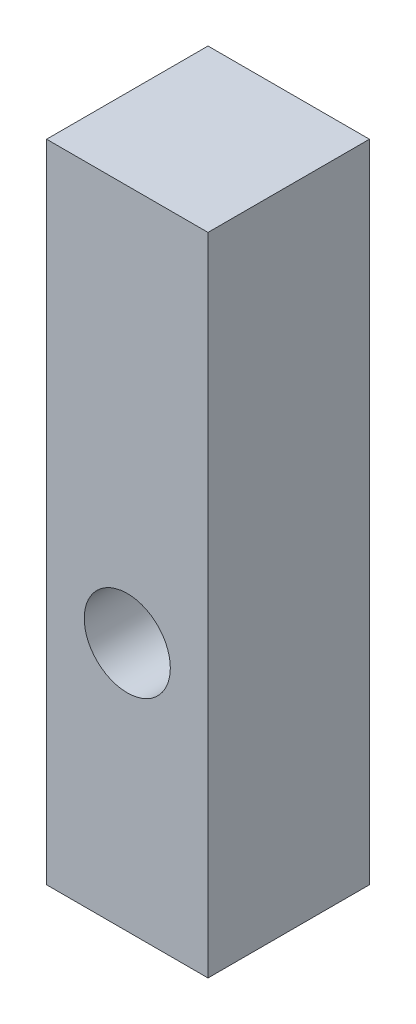
ISO-10303-21;
HEADER;
FILE_DESCRIPTION(('STEP AP214'),'2;1');
FILE_NAME('part.step','',(''),(''),'','','');
FILE_SCHEMA(('AUTOMOTIVE_DESIGN { 1 0 10303 214 1 1 1 1 }'));
ENDSEC;
DATA;
#1=APPLICATION_CONTEXT('core data for automotive mechanical design processes');
#2=APPLICATION_PROTOCOL_DEFINITION('international standard','automotive_design',2000,#1);
#3=PRODUCT_CONTEXT('',#1,'mechanical');
#4=PRODUCT('Part','Part','',(#3));
#5=PRODUCT_RELATED_PRODUCT_CATEGORY('part','',(#4));
#6=PRODUCT_DEFINITION_FORMATION('','',#4);
#7=PRODUCT_DEFINITION_CONTEXT('part definition',#1,'design');
#8=PRODUCT_DEFINITION('design','',#6,#7);
#9=PRODUCT_DEFINITION_SHAPE('','',#8);
#10=(LENGTH_UNIT() NAMED_UNIT(*) SI_UNIT(.MILLI.,.METRE.));
#11=(NAMED_UNIT(*) PLANE_ANGLE_UNIT() SI_UNIT($,.RADIAN.));
#12=(NAMED_UNIT(*) SI_UNIT($,.STERADIAN.) SOLID_ANGLE_UNIT());
#13=UNCERTAINTY_MEASURE_WITH_UNIT(LENGTH_MEASURE(1.E-05),#10,'distance_accuracy_value','');
#14=(GEOMETRIC_REPRESENTATION_CONTEXT(3) GLOBAL_UNCERTAINTY_ASSIGNED_CONTEXT((#13)) GLOBAL_UNIT_ASSIGNED_CONTEXT((#10,
#11,#12)) REPRESENTATION_CONTEXT('',''));
#15=CARTESIAN_POINT('',(0.,0.,0.));
#16=DIRECTION('',(0.,0.,1.));
#17=DIRECTION('',(1.,0.,0.));
#18=AXIS2_PLACEMENT_3D('',#15,#16,#17);
#19=CARTESIAN_POINT('',(-7.5,60.,7.5));
#20=DIRECTION('',(1.,0.,0.));
#21=DIRECTION('',(0.,0.,-1.));
#22=AXIS2_PLACEMENT_3D('',#19,#20,#21);
#23=PLANE('',#22);
#24=DIRECTION('',(0.,0.,1.));
#25=VECTOR('',#24,1.);
#26=CARTESIAN_POINT('',(-7.5,0.,7.5));
#27=LINE('',#26,#25);
#28=CARTESIAN_POINT('',(-7.5,0.,-7.5));
#29=VERTEX_POINT('',#28);
#30=CARTESIAN_POINT('',(-7.5,0.,7.5));
#31=VERTEX_POINT('',#30);
#32=EDGE_CURVE('E98',#29,#31,#27,.T.);
#33=ORIENTED_EDGE('',*,*,#32,.T.);
#34=DIRECTION('',(0.,-1.,0.));
#35=VECTOR('',#34,1.);
#36=CARTESIAN_POINT('',(-7.5,60.,7.5));
#37=LINE('',#36,#35);
#38=CARTESIAN_POINT('',(-7.5,60.,7.5));
#39=VERTEX_POINT('',#38);
#40=EDGE_CURVE('E11',#39,#31,#37,.T.);
#41=ORIENTED_EDGE('',*,*,#40,.F.);
#42=DIRECTION('',(0.,0.,1.));
#43=VECTOR('',#42,1.);
#44=CARTESIAN_POINT('',(-7.5,60.,7.5));
#45=LINE('',#44,#43);
#46=CARTESIAN_POINT('',(-7.5,60.,-7.5));
#47=VERTEX_POINT('',#46);
#48=EDGE_CURVE('E86',#47,#39,#45,.T.);
#49=ORIENTED_EDGE('',*,*,#48,.F.);
#50=DIRECTION('',(0.,-1.,0.));
#51=VECTOR('',#50,1.);
#52=CARTESIAN_POINT('',(-7.5,60.,-7.5));
#53=LINE('',#52,#51);
#54=EDGE_CURVE('E94',#47,#29,#53,.T.);
#55=ORIENTED_EDGE('',*,*,#54,.T.);
#56=EDGE_LOOP('',(#33,#41,#49,#55));
#57=FACE_BOUND('',#56,.T.);
#58=ADVANCED_FACE('F35',(#57),#23,.F.);
#59=CARTESIAN_POINT('',(7.5,60.,7.5));
#60=DIRECTION('',(0.,0.,-1.));
#61=DIRECTION('',(-1.,0.,0.));
#62=AXIS2_PLACEMENT_3D('',#59,#60,#61);
#63=PLANE('',#62);
#64=CARTESIAN_POINT('',(0.,23.1963004878395,7.5));
#65=DIRECTION('',(0.,0.,1.));
#66=DIRECTION('',(1.,0.,0.));
#67=AXIS2_PLACEMENT_3D('',#64,#65,#66);
#68=CIRCLE('',#67,4.);
#69=CARTESIAN_POINT('',(4.,23.1963004878395,7.5));
#70=VERTEX_POINT('',#69);
#71=EDGE_CURVE('E112',#70,#70,#68,.T.);
#72=ORIENTED_EDGE('',*,*,#71,.F.);
#73=EDGE_LOOP('',(#72));
#74=FACE_BOUND('',#73,.T.);
#75=DIRECTION('',(1.,0.,0.));
#76=VECTOR('',#75,1.);
#77=CARTESIAN_POINT('',(7.5,0.,7.5));
#78=LINE('',#77,#76);
#79=CARTESIAN_POINT('',(7.5,0.,7.5));
#80=VERTEX_POINT('',#79);
#81=EDGE_CURVE('E90',#31,#80,#78,.T.);
#82=ORIENTED_EDGE('',*,*,#81,.T.);
#83=DIRECTION('',(0.,-1.,0.));
#84=VECTOR('',#83,1.);
#85=CARTESIAN_POINT('',(7.5,60.,7.5));
#86=LINE('',#85,#84);
#87=CARTESIAN_POINT('',(7.5,60.,7.5));
#88=VERTEX_POINT('',#87);
#89=EDGE_CURVE('E43',#88,#80,#86,.T.);
#90=ORIENTED_EDGE('',*,*,#89,.F.);
#91=DIRECTION('',(1.,0.,0.));
#92=VECTOR('',#91,1.);
#93=CARTESIAN_POINT('',(7.5,60.,7.5));
#94=LINE('',#93,#92);
#95=EDGE_CURVE('E81',#39,#88,#94,.T.);
#96=ORIENTED_EDGE('',*,*,#95,.F.);
#97=ORIENTED_EDGE('',*,*,#40,.T.);
#98=EDGE_LOOP('',(#82,#90,#96,#97));
#99=FACE_BOUND('',#98,.T.);
#100=ADVANCED_FACE('F89',(#74,#99),#63,.F.);
#101=CARTESIAN_POINT('',(7.5,60.,7.5));
#102=DIRECTION('',(-1.,0.,0.));
#103=DIRECTION('',(0.,0.,1.));
#104=AXIS2_PLACEMENT_3D('',#101,#102,#103);
#105=PLANE('',#104);
#106=DIRECTION('',(0.,0.,-1.));
#107=VECTOR('',#106,1.);
#108=CARTESIAN_POINT('',(7.5,0.,7.5));
#109=LINE('',#108,#107);
#110=CARTESIAN_POINT('',(7.5,0.,-7.5));
#111=VERTEX_POINT('',#110);
#112=EDGE_CURVE('E68',#80,#111,#109,.T.);
#113=ORIENTED_EDGE('',*,*,#112,.T.);
#114=DIRECTION('',(0.,-1.,0.));
#115=VECTOR('',#114,1.);
#116=CARTESIAN_POINT('',(7.5,60.,-7.5));
#117=LINE('',#116,#115);
#118=CARTESIAN_POINT('',(7.5,60.,-7.5));
#119=VERTEX_POINT('',#118);
#120=EDGE_CURVE('E91',#119,#111,#117,.T.);
#121=ORIENTED_EDGE('',*,*,#120,.F.);
#122=DIRECTION('',(0.,0.,-1.));
#123=VECTOR('',#122,1.);
#124=CARTESIAN_POINT('',(7.5,60.,7.5));
#125=LINE('',#124,#123);
#126=EDGE_CURVE('E84',#88,#119,#125,.T.);
#127=ORIENTED_EDGE('',*,*,#126,.F.);
#128=ORIENTED_EDGE('',*,*,#89,.T.);
#129=EDGE_LOOP('',(#113,#121,#127,#128));
#130=FACE_BOUND('',#129,.T.);
#131=ADVANCED_FACE('F92',(#130),#105,.F.);
#132=CARTESIAN_POINT('',(7.5,60.,-7.5));
#133=DIRECTION('',(0.,0.,1.));
#134=DIRECTION('',(1.,0.,0.));
#135=AXIS2_PLACEMENT_3D('',#132,#133,#134);
#136=PLANE('',#135);
#137=CARTESIAN_POINT('',(0.,23.1963004878395,-7.5));
#138=DIRECTION('',(0.,0.,1.));
#139=DIRECTION('',(1.,0.,0.));
#140=AXIS2_PLACEMENT_3D('',#137,#138,#139);
#141=CIRCLE('',#140,4.);
#142=CARTESIAN_POINT('',(4.,23.1963004878395,-7.5));
#143=VERTEX_POINT('',#142);
#144=EDGE_CURVE('E101',#143,#143,#141,.T.);
#145=ORIENTED_EDGE('',*,*,#144,.T.);
#146=EDGE_LOOP('',(#145));
#147=FACE_BOUND('',#146,.T.);
#148=DIRECTION('',(-1.,0.,0.));
#149=VECTOR('',#148,1.);
#150=CARTESIAN_POINT('',(7.5,0.,-7.5));
#151=LINE('',#150,#149);
#152=EDGE_CURVE('E74',#111,#29,#151,.T.);
#153=ORIENTED_EDGE('',*,*,#152,.T.);
#154=ORIENTED_EDGE('',*,*,#54,.F.);
#155=DIRECTION('',(-1.,0.,0.));
#156=VECTOR('',#155,1.);
#157=CARTESIAN_POINT('',(7.5,60.,-7.5));
#158=LINE('',#157,#156);
#159=EDGE_CURVE('E51',#119,#47,#158,.T.);
#160=ORIENTED_EDGE('',*,*,#159,.F.);
#161=ORIENTED_EDGE('',*,*,#120,.T.);
#162=EDGE_LOOP('',(#153,#154,#160,#161));
#163=FACE_BOUND('',#162,.T.);
#164=ADVANCED_FACE('F106',(#147,#163),#136,.F.);
#165=CARTESIAN_POINT('',(0.,60.,0.));
#166=DIRECTION('',(0.,1.,0.));
#167=DIRECTION('',(0.,0.,1.));
#168=AXIS2_PLACEMENT_3D('',#165,#166,#167);
#169=PLANE('',#168);
#170=ORIENTED_EDGE('',*,*,#48,.T.);
#171=ORIENTED_EDGE('',*,*,#95,.T.);
#172=ORIENTED_EDGE('',*,*,#126,.T.);
#173=ORIENTED_EDGE('',*,*,#159,.T.);
#174=EDGE_LOOP('',(#170,#171,#172,#173));
#175=FACE_BOUND('',#174,.T.);
#176=ADVANCED_FACE('F82',(#175),#169,.T.);
#177=CARTESIAN_POINT('',(0.,0.,0.));
#178=DIRECTION('',(0.,1.,0.));
#179=DIRECTION('',(0.,0.,1.));
#180=AXIS2_PLACEMENT_3D('',#177,#178,#179);
#181=PLANE('',#180);
#182=ORIENTED_EDGE('',*,*,#32,.F.);
#183=ORIENTED_EDGE('',*,*,#152,.F.);
#184=ORIENTED_EDGE('',*,*,#112,.F.);
#185=ORIENTED_EDGE('',*,*,#81,.F.);
#186=EDGE_LOOP('',(#182,#183,#184,#185));
#187=FACE_BOUND('',#186,.T.);
#188=ADVANCED_FACE('F109',(#187),#181,.F.);
#189=CARTESIAN_POINT('',(0.,23.1963004878395,-7.5));
#190=DIRECTION('',(0.,0.,1.));
#191=DIRECTION('',(1.,0.,0.));
#192=AXIS2_PLACEMENT_3D('',#189,#190,#191);
#193=CYLINDRICAL_SURFACE('',#192,4.);
#194=ORIENTED_EDGE('',*,*,#144,.F.);
#195=EDGE_LOOP('',(#194));
#196=FACE_BOUND('',#195,.T.);
#197=ORIENTED_EDGE('',*,*,#71,.T.);
#198=EDGE_LOOP('',(#197));
#199=FACE_BOUND('',#198,.T.);
#200=ADVANCED_FACE('F119',(#196,#199),#193,.F.);
#201=CLOSED_SHELL('',(#58,#100,#131,#164,#176,#188,#200));
#202=MANIFOLD_SOLID_BREP('B2',#201);
#203=ADVANCED_BREP_SHAPE_REPRESENTATION('',(#18,#202),#14);
#204=SHAPE_DEFINITION_REPRESENTATION(#9,#203);
ENDSEC;
END-ISO-10303-21;
